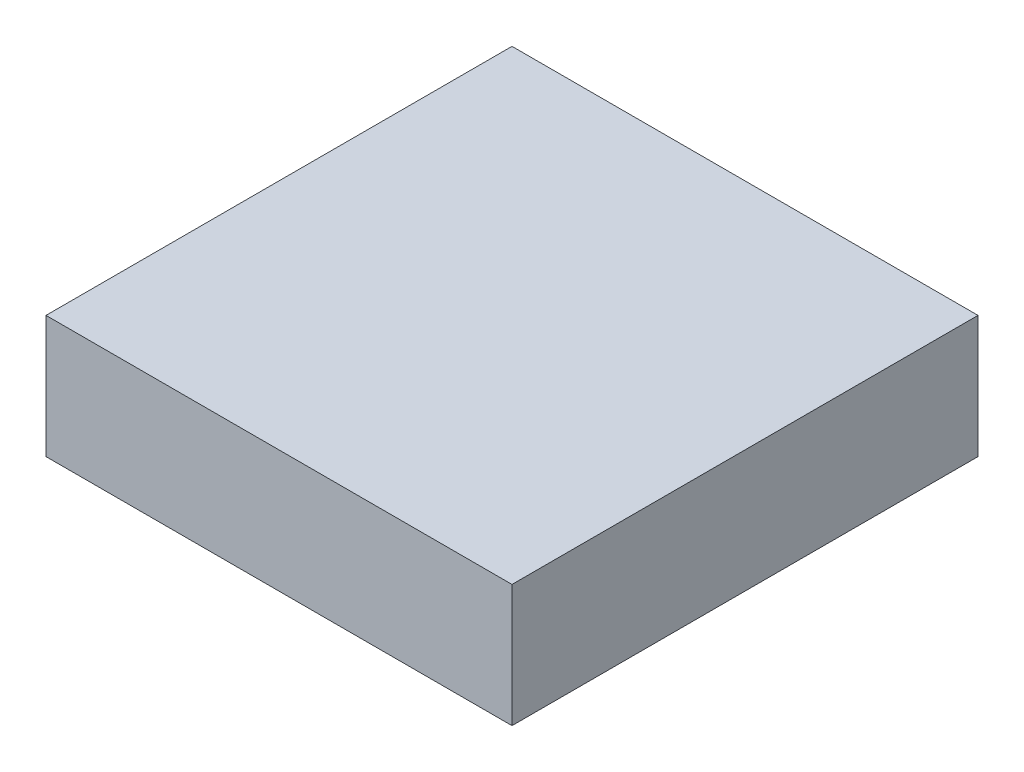
ISO-10303-21;
HEADER;
FILE_DESCRIPTION(('STEP AP214'),'2;1');
FILE_NAME('part.step','',(''),(''),'','','');
FILE_SCHEMA(('AUTOMOTIVE_DESIGN { 1 0 10303 214 1 1 1 1 }'));
ENDSEC;
DATA;
#1=APPLICATION_CONTEXT('core data for automotive mechanical design processes');
#2=APPLICATION_PROTOCOL_DEFINITION('international standard','automotive_design',2000,#1);
#3=PRODUCT_CONTEXT('',#1,'mechanical');
#4=PRODUCT('Part','Part','',(#3));
#5=PRODUCT_RELATED_PRODUCT_CATEGORY('part','',(#4));
#6=PRODUCT_DEFINITION_FORMATION('','',#4);
#7=PRODUCT_DEFINITION_CONTEXT('part definition',#1,'design');
#8=PRODUCT_DEFINITION('design','',#6,#7);
#9=PRODUCT_DEFINITION_SHAPE('','',#8);
#10=(LENGTH_UNIT() NAMED_UNIT(*) SI_UNIT(.MILLI.,.METRE.));
#11=(NAMED_UNIT(*) PLANE_ANGLE_UNIT() SI_UNIT($,.RADIAN.));
#12=(NAMED_UNIT(*) SI_UNIT($,.STERADIAN.) SOLID_ANGLE_UNIT());
#13=UNCERTAINTY_MEASURE_WITH_UNIT(LENGTH_MEASURE(1.E-05),#10,'distance_accuracy_value','');
#14=(GEOMETRIC_REPRESENTATION_CONTEXT(3) GLOBAL_UNCERTAINTY_ASSIGNED_CONTEXT((#13)) GLOBAL_UNIT_ASSIGNED_CONTEXT((#10,
#11,#12)) REPRESENTATION_CONTEXT('',''));
#15=CARTESIAN_POINT('',(0.,0.,0.));
#16=DIRECTION('',(0.,0.,1.));
#17=DIRECTION('',(1.,0.,0.));
#18=AXIS2_PLACEMENT_3D('',#15,#16,#17);
#19=CARTESIAN_POINT('',(-2.,1.05,-2.));
#20=DIRECTION('',(1.,0.,0.));
#21=DIRECTION('',(0.,0.,-1.));
#22=AXIS2_PLACEMENT_3D('',#19,#20,#21);
#23=PLANE('',#22);
#24=DIRECTION('',(0.,0.,1.));
#25=VECTOR('',#24,1.);
#26=CARTESIAN_POINT('',(-2.,0.,-2.));
#27=LINE('',#26,#25);
#28=CARTESIAN_POINT('',(-2.,0.,-2.));
#29=VERTEX_POINT('',#28);
#30=CARTESIAN_POINT('',(-2.,0.,2.));
#31=VERTEX_POINT('',#30);
#32=EDGE_CURVE('E95',#29,#31,#27,.T.);
#33=ORIENTED_EDGE('',*,*,#32,.T.);
#34=DIRECTION('',(0.,-1.,0.));
#35=VECTOR('',#34,1.);
#36=CARTESIAN_POINT('',(-2.,1.05,2.));
#37=LINE('',#36,#35);
#38=CARTESIAN_POINT('',(-2.,1.05,2.));
#39=VERTEX_POINT('',#38);
#40=EDGE_CURVE('E11',#39,#31,#37,.T.);
#41=ORIENTED_EDGE('',*,*,#40,.F.);
#42=DIRECTION('',(0.,0.,1.));
#43=VECTOR('',#42,1.);
#44=CARTESIAN_POINT('',(-2.,1.05,-2.));
#45=LINE('',#44,#43);
#46=CARTESIAN_POINT('',(-2.,1.05,-2.));
#47=VERTEX_POINT('',#46);
#48=EDGE_CURVE('E83',#47,#39,#45,.T.);
#49=ORIENTED_EDGE('',*,*,#48,.F.);
#50=DIRECTION('',(0.,-1.,0.));
#51=VECTOR('',#50,1.);
#52=CARTESIAN_POINT('',(-2.,1.05,-2.));
#53=LINE('',#52,#51);
#54=EDGE_CURVE('E91',#47,#29,#53,.T.);
#55=ORIENTED_EDGE('',*,*,#54,.T.);
#56=EDGE_LOOP('',(#33,#41,#49,#55));
#57=FACE_BOUND('',#56,.T.);
#58=ADVANCED_FACE('F32',(#57),#23,.F.);
#59=CARTESIAN_POINT('',(2.,1.05,2.));
#60=DIRECTION('',(0.,0.,-1.));
#61=DIRECTION('',(-1.,0.,0.));
#62=AXIS2_PLACEMENT_3D('',#59,#60,#61);
#63=PLANE('',#62);
#64=DIRECTION('',(1.,0.,0.));
#65=VECTOR('',#64,1.);
#66=CARTESIAN_POINT('',(2.,0.,2.));
#67=LINE('',#66,#65);
#68=CARTESIAN_POINT('',(2.,0.,2.));
#69=VERTEX_POINT('',#68);
#70=EDGE_CURVE('E87',#31,#69,#67,.T.);
#71=ORIENTED_EDGE('',*,*,#70,.T.);
#72=DIRECTION('',(0.,-1.,0.));
#73=VECTOR('',#72,1.);
#74=CARTESIAN_POINT('',(2.,1.05,2.));
#75=LINE('',#74,#73);
#76=CARTESIAN_POINT('',(2.,1.05,2.));
#77=VERTEX_POINT('',#76);
#78=EDGE_CURVE('E40',#77,#69,#75,.T.);
#79=ORIENTED_EDGE('',*,*,#78,.F.);
#80=DIRECTION('',(1.,0.,0.));
#81=VECTOR('',#80,1.);
#82=CARTESIAN_POINT('',(2.,1.05,2.));
#83=LINE('',#82,#81);
#84=EDGE_CURVE('E78',#39,#77,#83,.T.);
#85=ORIENTED_EDGE('',*,*,#84,.F.);
#86=ORIENTED_EDGE('',*,*,#40,.T.);
#87=EDGE_LOOP('',(#71,#79,#85,#86));
#88=FACE_BOUND('',#87,.T.);
#89=ADVANCED_FACE('F86',(#88),#63,.F.);
#90=CARTESIAN_POINT('',(2.,1.05,-2.));
#91=DIRECTION('',(-1.,0.,0.));
#92=DIRECTION('',(0.,0.,1.));
#93=AXIS2_PLACEMENT_3D('',#90,#91,#92);
#94=PLANE('',#93);
#95=DIRECTION('',(0.,0.,-1.));
#96=VECTOR('',#95,1.);
#97=CARTESIAN_POINT('',(2.,0.,-2.));
#98=LINE('',#97,#96);
#99=CARTESIAN_POINT('',(2.,0.,-2.));
#100=VERTEX_POINT('',#99);
#101=EDGE_CURVE('E65',#69,#100,#98,.T.);
#102=ORIENTED_EDGE('',*,*,#101,.T.);
#103=DIRECTION('',(0.,-1.,0.));
#104=VECTOR('',#103,1.);
#105=CARTESIAN_POINT('',(2.,1.05,-2.));
#106=LINE('',#105,#104);
#107=CARTESIAN_POINT('',(2.,1.05,-2.));
#108=VERTEX_POINT('',#107);
#109=EDGE_CURVE('E88',#108,#100,#106,.T.);
#110=ORIENTED_EDGE('',*,*,#109,.F.);
#111=DIRECTION('',(0.,0.,-1.));
#112=VECTOR('',#111,1.);
#113=CARTESIAN_POINT('',(2.,1.05,-2.));
#114=LINE('',#113,#112);
#115=EDGE_CURVE('E81',#77,#108,#114,.T.);
#116=ORIENTED_EDGE('',*,*,#115,.F.);
#117=ORIENTED_EDGE('',*,*,#78,.T.);
#118=EDGE_LOOP('',(#102,#110,#116,#117));
#119=FACE_BOUND('',#118,.T.);
#120=ADVANCED_FACE('F89',(#119),#94,.F.);
#121=CARTESIAN_POINT('',(2.,1.05,-2.));
#122=DIRECTION('',(0.,0.,1.));
#123=DIRECTION('',(1.,0.,0.));
#124=AXIS2_PLACEMENT_3D('',#121,#122,#123);
#125=PLANE('',#124);
#126=DIRECTION('',(-1.,0.,0.));
#127=VECTOR('',#126,1.);
#128=CARTESIAN_POINT('',(2.,0.,-2.));
#129=LINE('',#128,#127);
#130=EDGE_CURVE('E71',#100,#29,#129,.T.);
#131=ORIENTED_EDGE('',*,*,#130,.T.);
#132=ORIENTED_EDGE('',*,*,#54,.F.);
#133=DIRECTION('',(-1.,0.,0.));
#134=VECTOR('',#133,1.);
#135=CARTESIAN_POINT('',(2.,1.05,-2.));
#136=LINE('',#135,#134);
#137=EDGE_CURVE('E48',#108,#47,#136,.T.);
#138=ORIENTED_EDGE('',*,*,#137,.F.);
#139=ORIENTED_EDGE('',*,*,#109,.T.);
#140=EDGE_LOOP('',(#131,#132,#138,#139));
#141=FACE_BOUND('',#140,.T.);
#142=ADVANCED_FACE('F102',(#141),#125,.F.);
#143=CARTESIAN_POINT('',(0.,1.05,0.));
#144=DIRECTION('',(0.,-1.,0.));
#145=DIRECTION('',(0.,0.,-1.));
#146=AXIS2_PLACEMENT_3D('',#143,#144,#145);
#147=PLANE('',#146);
#148=ORIENTED_EDGE('',*,*,#48,.T.);
#149=ORIENTED_EDGE('',*,*,#84,.T.);
#150=ORIENTED_EDGE('',*,*,#115,.T.);
#151=ORIENTED_EDGE('',*,*,#137,.T.);
#152=EDGE_LOOP('',(#148,#149,#150,#151));
#153=FACE_BOUND('',#152,.T.);
#154=ADVANCED_FACE('F79',(#153),#147,.F.);
#155=CARTESIAN_POINT('',(0.,0.,0.));
#156=DIRECTION('',(0.,-1.,0.));
#157=DIRECTION('',(0.,0.,-1.));
#158=AXIS2_PLACEMENT_3D('',#155,#156,#157);
#159=PLANE('',#158);
#160=ORIENTED_EDGE('',*,*,#32,.F.);
#161=ORIENTED_EDGE('',*,*,#130,.F.);
#162=ORIENTED_EDGE('',*,*,#101,.F.);
#163=ORIENTED_EDGE('',*,*,#70,.F.);
#164=EDGE_LOOP('',(#160,#161,#162,#163));
#165=FACE_BOUND('',#164,.T.);
#166=ADVANCED_FACE('F105',(#165),#159,.T.);
#167=CLOSED_SHELL('',(#58,#89,#120,#142,#154,#166));
#168=MANIFOLD_SOLID_BREP('B2',#167);
#169=ADVANCED_BREP_SHAPE_REPRESENTATION('',(#18,#168),#14);
#170=SHAPE_DEFINITION_REPRESENTATION(#9,#169);
ENDSEC;
END-ISO-10303-21;
